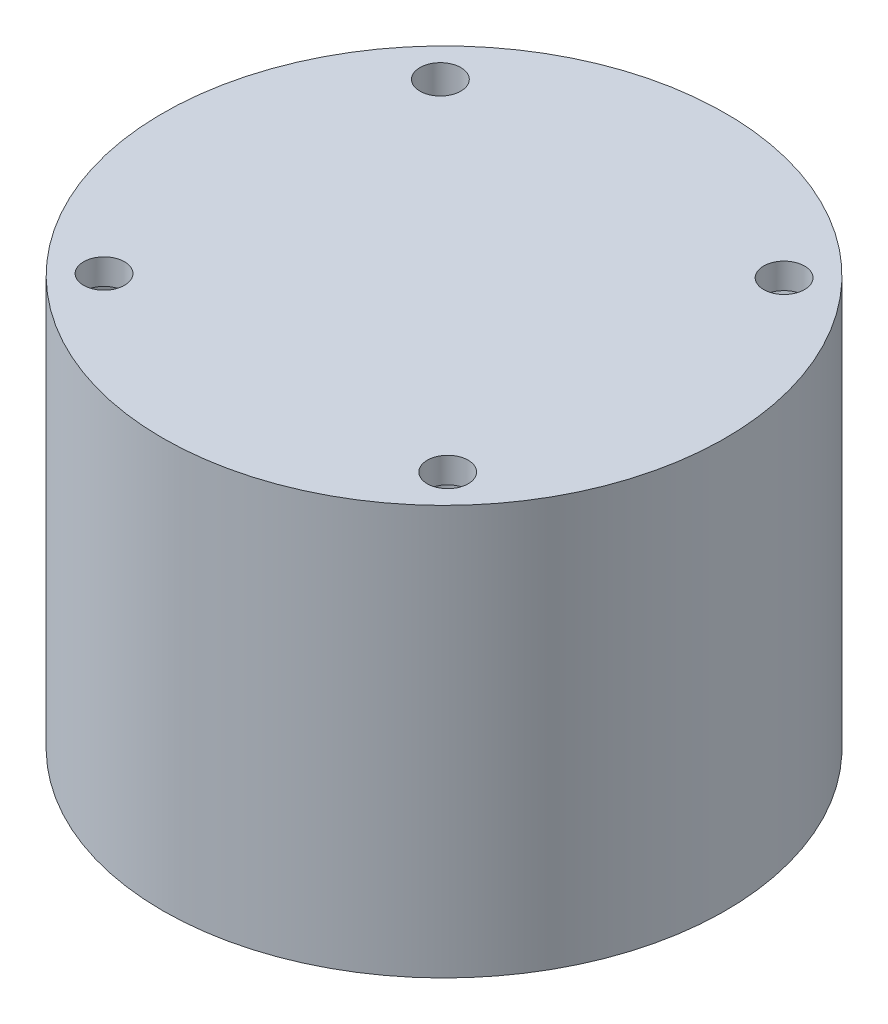
ISO-10303-21;
HEADER;
FILE_DESCRIPTION(('STEP AP214'),'2;1');
FILE_NAME('part.step','',(''),(''),'','','');
FILE_SCHEMA(('AUTOMOTIVE_DESIGN { 1 0 10303 214 1 1 1 1 }'));
ENDSEC;
DATA;
#1=APPLICATION_CONTEXT('core data for automotive mechanical design processes');
#2=APPLICATION_PROTOCOL_DEFINITION('international standard','automotive_design',2000,#1);
#3=PRODUCT_CONTEXT('',#1,'mechanical');
#4=PRODUCT('Part','Part','',(#3));
#5=PRODUCT_RELATED_PRODUCT_CATEGORY('part','',(#4));
#6=PRODUCT_DEFINITION_FORMATION('','',#4);
#7=PRODUCT_DEFINITION_CONTEXT('part definition',#1,'design');
#8=PRODUCT_DEFINITION('design','',#6,#7);
#9=PRODUCT_DEFINITION_SHAPE('','',#8);
#10=(LENGTH_UNIT() NAMED_UNIT(*) SI_UNIT(.MILLI.,.METRE.));
#11=(NAMED_UNIT(*) PLANE_ANGLE_UNIT() SI_UNIT($,.RADIAN.));
#12=(NAMED_UNIT(*) SI_UNIT($,.STERADIAN.) SOLID_ANGLE_UNIT());
#13=UNCERTAINTY_MEASURE_WITH_UNIT(LENGTH_MEASURE(1.E-05),#10,'distance_accuracy_value','');
#14=(GEOMETRIC_REPRESENTATION_CONTEXT(3) GLOBAL_UNCERTAINTY_ASSIGNED_CONTEXT((#13)) GLOBAL_UNIT_ASSIGNED_CONTEXT((#10,
#11,#12)) REPRESENTATION_CONTEXT('',''));
#15=CARTESIAN_POINT('',(0.,0.,0.));
#16=DIRECTION('',(0.,0.,1.));
#17=DIRECTION('',(1.,0.,0.));
#18=AXIS2_PLACEMENT_3D('',#15,#16,#17);
#19=CARTESIAN_POINT('',(0.,75.,0.));
#20=DIRECTION('',(0.,-1.,0.));
#21=DIRECTION('',(0.,0.,-1.));
#22=AXIS2_PLACEMENT_3D('',#19,#20,#21);
#23=CYLINDRICAL_SURFACE('',#22,50.);
#24=CARTESIAN_POINT('',(0.,75.,0.));
#25=DIRECTION('',(0.,-1.,0.));
#26=DIRECTION('',(0.,0.,-1.));
#27=AXIS2_PLACEMENT_3D('',#24,#25,#26);
#28=CIRCLE('',#27,50.);
#29=CARTESIAN_POINT('',(-37.590562846943,75.,32.9689184664894));
#30=VERTEX_POINT('',#29);
#31=CARTESIAN_POINT('',(-37.590562846943,75.,-32.9689184664894));
#32=VERTEX_POINT('',#31);
#33=EDGE_CURVE('E170',#30,#32,#28,.T.);
#34=ORIENTED_EDGE('',*,*,#33,.F.);
#35=DIRECTION('',(0.,1.,0.));
#36=VECTOR('',#35,1.);
#37=CARTESIAN_POINT('',(-37.5905628469429,40.,32.9689184664894));
#38=LINE('',#37,#36);
#39=CARTESIAN_POINT('',(-37.5905628469429,0.,32.9689184664895));
#40=VERTEX_POINT('',#39);
#41=EDGE_CURVE('E143',#30,#40,#38,.F.);
#42=ORIENTED_EDGE('',*,*,#41,.T.);
#43=CARTESIAN_POINT('',(0.,0.,0.));
#44=DIRECTION('',(0.,-1.,0.));
#45=DIRECTION('',(0.,0.,-1.));
#46=AXIS2_PLACEMENT_3D('',#43,#44,#45);
#47=CIRCLE('',#46,50.);
#48=CARTESIAN_POINT('',(-37.5905628469429,0.,-32.9689184664895));
#49=VERTEX_POINT('',#48);
#50=EDGE_CURVE('E126',#40,#49,#47,.T.);
#51=ORIENTED_EDGE('',*,*,#50,.T.);
#52=DIRECTION('',(0.,1.,0.));
#53=VECTOR('',#52,1.);
#54=CARTESIAN_POINT('',(-37.5905628469429,40.,-32.9689184664894));
#55=LINE('',#54,#53);
#56=EDGE_CURVE('E114',#49,#32,#55,.T.);
#57=ORIENTED_EDGE('',*,*,#56,.T.);
#58=EDGE_LOOP('',(#34,#42,#51,#57));
#59=FACE_BOUND('',#58,.T.);
#60=ADVANCED_FACE('F34',(#59),#23,.F.);
#61=CARTESIAN_POINT('',(-33.7747495446767,75.,-36.8682287775581));
#62=VERTEX_POINT('',#61);
#63=CARTESIAN_POINT('',(33.7747495446767,75.,-36.8682287775581));
#64=VERTEX_POINT('',#63);
#65=EDGE_CURVE('E135',#62,#64,#28,.T.);
#66=ORIENTED_EDGE('',*,*,#65,.F.);
#67=DIRECTION('',(0.,1.,0.));
#68=VECTOR('',#67,1.);
#69=CARTESIAN_POINT('',(-33.7747495446767,40.,-36.868228777558));
#70=LINE('',#69,#68);
#71=CARTESIAN_POINT('',(-33.7747495446768,0.,-36.868228777558));
#72=VERTEX_POINT('',#71);
#73=EDGE_CURVE('E57',#62,#72,#70,.F.);
#74=ORIENTED_EDGE('',*,*,#73,.T.);
#75=CARTESIAN_POINT('',(33.7747495446768,0.,-36.868228777558));
#76=VERTEX_POINT('',#75);
#77=EDGE_CURVE('E122',#72,#76,#47,.T.);
#78=ORIENTED_EDGE('',*,*,#77,.T.);
#79=DIRECTION('',(0.,1.,0.));
#80=VECTOR('',#79,1.);
#81=CARTESIAN_POINT('',(33.7747495446767,40.,-36.868228777558));
#82=LINE('',#81,#80);
#83=EDGE_CURVE('E99',#76,#64,#82,.T.);
#84=ORIENTED_EDGE('',*,*,#83,.T.);
#85=EDGE_LOOP('',(#66,#74,#78,#84));
#86=FACE_BOUND('',#85,.T.);
#87=ADVANCED_FACE('F183',(#86),#23,.F.);
#88=CARTESIAN_POINT('',(37.590562846943,75.,-32.9689184664895));
#89=VERTEX_POINT('',#88);
#90=CARTESIAN_POINT('',(37.590562846943,75.,32.9689184664894));
#91=VERTEX_POINT('',#90);
#92=EDGE_CURVE('E113',#89,#91,#28,.T.);
#93=ORIENTED_EDGE('',*,*,#92,.F.);
#94=DIRECTION('',(0.,1.,0.));
#95=VECTOR('',#94,1.);
#96=CARTESIAN_POINT('',(37.5905628469429,40.,-32.9689184664895));
#97=LINE('',#96,#95);
#98=CARTESIAN_POINT('',(37.5905628469429,0.,-32.9689184664896));
#99=VERTEX_POINT('',#98);
#100=EDGE_CURVE('E49',#89,#99,#97,.F.);
#101=ORIENTED_EDGE('',*,*,#100,.T.);
#102=CARTESIAN_POINT('',(37.5905628469429,0.,32.9689184664895));
#103=VERTEX_POINT('',#102);
#104=EDGE_CURVE('E111',#99,#103,#47,.T.);
#105=ORIENTED_EDGE('',*,*,#104,.T.);
#106=DIRECTION('',(0.,1.,0.));
#107=VECTOR('',#106,1.);
#108=CARTESIAN_POINT('',(37.5905628469429,40.,32.9689184664894));
#109=LINE('',#108,#107);
#110=EDGE_CURVE('E128',#103,#91,#109,.T.);
#111=ORIENTED_EDGE('',*,*,#110,.T.);
#112=EDGE_LOOP('',(#93,#101,#105,#111));
#113=FACE_BOUND('',#112,.T.);
#114=ADVANCED_FACE('F109',(#113),#23,.F.);
#115=CARTESIAN_POINT('',(0.,80.,0.));
#116=DIRECTION('',(0.,-1.,0.));
#117=DIRECTION('',(0.,0.,-1.));
#118=AXIS2_PLACEMENT_3D('',#115,#116,#117);
#119=CYLINDRICAL_SURFACE('',#118,55.);
#120=CARTESIAN_POINT('',(0.,80.,0.));
#121=DIRECTION('',(0.,1.,0.));
#122=DIRECTION('',(0.,0.,1.));
#123=AXIS2_PLACEMENT_3D('',#120,#121,#122);
#124=CIRCLE('',#123,55.);
#125=CARTESIAN_POINT('',(0.,80.,55.));
#126=VERTEX_POINT('',#125);
#127=EDGE_CURVE('E176',#126,#126,#124,.T.);
#128=ORIENTED_EDGE('',*,*,#127,.F.);
#129=EDGE_LOOP('',(#128));
#130=FACE_BOUND('',#129,.T.);
#131=CARTESIAN_POINT('',(0.,0.,0.));
#132=DIRECTION('',(0.,1.,0.));
#133=DIRECTION('',(0.,0.,1.));
#134=AXIS2_PLACEMENT_3D('',#131,#132,#133);
#135=CIRCLE('',#134,55.);
#136=CARTESIAN_POINT('',(0.,0.,55.));
#137=VERTEX_POINT('',#136);
#138=EDGE_CURVE('E169',#137,#137,#135,.T.);
#139=ORIENTED_EDGE('',*,*,#138,.T.);
#140=EDGE_LOOP('',(#139));
#141=FACE_BOUND('',#140,.T.);
#142=ADVANCED_FACE('F36',(#130,#141),#119,.T.);
#143=CARTESIAN_POINT('',(0.,80.,0.));
#144=DIRECTION('',(0.,1.,0.));
#145=DIRECTION('',(0.,0.,1.));
#146=AXIS2_PLACEMENT_3D('',#143,#144,#145);
#147=PLANE('',#146);
#148=CARTESIAN_POINT('',(-33.5917270558466,80.,32.8724181253145));
#149=DIRECTION('',(0.,1.,0.));
#150=DIRECTION('',(0.,0.,1.));
#151=AXIS2_PLACEMENT_3D('',#148,#149,#150);
#152=CIRCLE('',#151,4.);
#153=CARTESIAN_POINT('',(-33.5917270558466,80.,36.8724181253145));
#154=VERTEX_POINT('',#153);
#155=EDGE_CURVE('E148',#154,#154,#152,.T.);
#156=ORIENTED_EDGE('',*,*,#155,.F.);
#157=EDGE_LOOP('',(#156));
#158=FACE_BOUND('',#157,.T.);
#159=CARTESIAN_POINT('',(-33.5917270558466,80.,-32.8724181253145));
#160=DIRECTION('',(0.,1.,0.));
#161=DIRECTION('',(0.,0.,1.));
#162=AXIS2_PLACEMENT_3D('',#159,#160,#161);
#163=CIRCLE('',#162,4.);
#164=CARTESIAN_POINT('',(-33.5917270558466,80.,-28.8724181253145));
#165=VERTEX_POINT('',#164);
#166=EDGE_CURVE('E104',#165,#165,#163,.T.);
#167=ORIENTED_EDGE('',*,*,#166,.F.);
#168=EDGE_LOOP('',(#167));
#169=FACE_BOUND('',#168,.T.);
#170=CARTESIAN_POINT('',(33.5917270558466,80.,-32.8724181253145));
#171=DIRECTION('',(0.,1.,0.));
#172=DIRECTION('',(0.,0.,1.));
#173=AXIS2_PLACEMENT_3D('',#170,#171,#172);
#174=CIRCLE('',#173,4.);
#175=CARTESIAN_POINT('',(33.5917270558466,80.,-28.8724181253145));
#176=VERTEX_POINT('',#175);
#177=EDGE_CURVE('E105',#176,#176,#174,.T.);
#178=ORIENTED_EDGE('',*,*,#177,.F.);
#179=EDGE_LOOP('',(#178));
#180=FACE_BOUND('',#179,.T.);
#181=CARTESIAN_POINT('',(33.5917270558466,80.,32.8724181253145));
#182=DIRECTION('',(0.,1.,0.));
#183=DIRECTION('',(0.,0.,1.));
#184=AXIS2_PLACEMENT_3D('',#181,#182,#183);
#185=CIRCLE('',#184,4.00000000000001);
#186=CARTESIAN_POINT('',(33.5917270558466,80.,36.8724181253145));
#187=VERTEX_POINT('',#186);
#188=EDGE_CURVE('E164',#187,#187,#185,.T.);
#189=ORIENTED_EDGE('',*,*,#188,.F.);
#190=EDGE_LOOP('',(#189));
#191=FACE_BOUND('',#190,.T.);
#192=ORIENTED_EDGE('',*,*,#127,.T.);
#193=EDGE_LOOP('',(#192));
#194=FACE_BOUND('',#193,.T.);
#195=ADVANCED_FACE('F195',(#158,#169,#180,#191,#194),#147,.T.);
#196=CARTESIAN_POINT('',(0.,0.,0.));
#197=DIRECTION('',(0.,1.,0.));
#198=DIRECTION('',(0.,0.,1.));
#199=AXIS2_PLACEMENT_3D('',#196,#197,#198);
#200=PLANE('',#199);
#201=ORIENTED_EDGE('',*,*,#50,.F.);
#202=CARTESIAN_POINT('',(-33.5917270558466,0.,32.8724181253145));
#203=DIRECTION('',(0.,1.,0.));
#204=DIRECTION('',(0.,0.,1.));
#205=AXIS2_PLACEMENT_3D('',#202,#203,#204);
#206=CIRCLE('',#205,4.);
#207=CARTESIAN_POINT('',(-33.7747495446768,0.,36.868228777558));
#208=VERTEX_POINT('',#207);
#209=EDGE_CURVE('E146',#40,#208,#206,.T.);
#210=ORIENTED_EDGE('',*,*,#209,.T.);
#211=CARTESIAN_POINT('',(33.7747495446768,0.,36.868228777558));
#212=VERTEX_POINT('',#211);
#213=EDGE_CURVE('E125',#212,#208,#47,.T.);
#214=ORIENTED_EDGE('',*,*,#213,.F.);
#215=CARTESIAN_POINT('',(33.5917270558466,0.,32.8724181253145));
#216=DIRECTION('',(0.,1.,0.));
#217=DIRECTION('',(0.,0.,1.));
#218=AXIS2_PLACEMENT_3D('',#215,#216,#217);
#219=CIRCLE('',#218,4.00000000000001);
#220=EDGE_CURVE('E121',#212,#103,#219,.T.);
#221=ORIENTED_EDGE('',*,*,#220,.T.);
#222=ORIENTED_EDGE('',*,*,#104,.F.);
#223=CARTESIAN_POINT('',(33.5917270558466,0.,-32.8724181253145));
#224=DIRECTION('',(0.,1.,0.));
#225=DIRECTION('',(0.,0.,1.));
#226=AXIS2_PLACEMENT_3D('',#223,#224,#225);
#227=CIRCLE('',#226,4.);
#228=EDGE_CURVE('E96',#99,#76,#227,.T.);
#229=ORIENTED_EDGE('',*,*,#228,.T.);
#230=ORIENTED_EDGE('',*,*,#77,.F.);
#231=CARTESIAN_POINT('',(-33.5917270558466,0.,-32.8724181253145));
#232=DIRECTION('',(0.,1.,0.));
#233=DIRECTION('',(0.,0.,1.));
#234=AXIS2_PLACEMENT_3D('',#231,#232,#233);
#235=CIRCLE('',#234,4.);
#236=EDGE_CURVE('E147',#72,#49,#235,.T.);
#237=ORIENTED_EDGE('',*,*,#236,.T.);
#238=EDGE_LOOP('',(#201,#210,#214,#221,#222,#229,#230,#237));
#239=FACE_BOUND('',#238,.T.);
#240=ORIENTED_EDGE('',*,*,#138,.F.);
#241=EDGE_LOOP('',(#240));
#242=FACE_BOUND('',#241,.T.);
#243=ADVANCED_FACE('F118',(#239,#242),#200,.F.);
#244=ORIENTED_EDGE('',*,*,#213,.T.);
#245=DIRECTION('',(0.,1.,0.));
#246=VECTOR('',#245,1.);
#247=CARTESIAN_POINT('',(-33.7747495446767,40.,36.868228777558));
#248=LINE('',#247,#246);
#249=CARTESIAN_POINT('',(-33.7747495446767,75.,36.8682287775581));
#250=VERTEX_POINT('',#249);
#251=EDGE_CURVE('E161',#208,#250,#248,.T.);
#252=ORIENTED_EDGE('',*,*,#251,.T.);
#253=CARTESIAN_POINT('',(33.7747495446767,75.,36.8682287775581));
#254=VERTEX_POINT('',#253);
#255=EDGE_CURVE('E136',#254,#250,#28,.T.);
#256=ORIENTED_EDGE('',*,*,#255,.F.);
#257=DIRECTION('',(0.,1.,0.));
#258=VECTOR('',#257,1.);
#259=CARTESIAN_POINT('',(33.7747495446767,40.,36.868228777558));
#260=LINE('',#259,#258);
#261=EDGE_CURVE('E123',#254,#212,#260,.F.);
#262=ORIENTED_EDGE('',*,*,#261,.T.);
#263=EDGE_LOOP('',(#244,#252,#256,#262));
#264=FACE_BOUND('',#263,.T.);
#265=ADVANCED_FACE('F190',(#264),#23,.F.);
#266=CARTESIAN_POINT('',(0.,75.,0.));
#267=DIRECTION('',(0.,-1.,0.));
#268=DIRECTION('',(0.,0.,-1.));
#269=AXIS2_PLACEMENT_3D('',#266,#267,#268);
#270=PLANE('',#269);
#271=CARTESIAN_POINT('',(-33.5917270558466,75.,32.8724181253145));
#272=DIRECTION('',(0.,-1.,0.));
#273=DIRECTION('',(0.,0.,-1.));
#274=AXIS2_PLACEMENT_3D('',#271,#272,#273);
#275=CIRCLE('',#274,4.);
#276=EDGE_CURVE('E11',#30,#250,#275,.T.);
#277=ORIENTED_EDGE('',*,*,#276,.F.);
#278=ORIENTED_EDGE('',*,*,#33,.T.);
#279=CARTESIAN_POINT('',(-33.5917270558466,75.,-32.8724181253145));
#280=DIRECTION('',(0.,-1.,0.));
#281=DIRECTION('',(0.,0.,-1.));
#282=AXIS2_PLACEMENT_3D('',#279,#280,#281);
#283=CIRCLE('',#282,4.);
#284=EDGE_CURVE('E42',#62,#32,#283,.T.);
#285=ORIENTED_EDGE('',*,*,#284,.F.);
#286=ORIENTED_EDGE('',*,*,#65,.T.);
#287=CARTESIAN_POINT('',(33.5917270558466,75.,-32.8724181253145));
#288=DIRECTION('',(0.,-1.,0.));
#289=DIRECTION('',(0.,0.,-1.));
#290=AXIS2_PLACEMENT_3D('',#287,#288,#289);
#291=CIRCLE('',#290,4.);
#292=EDGE_CURVE('E181',#89,#64,#291,.T.);
#293=ORIENTED_EDGE('',*,*,#292,.F.);
#294=ORIENTED_EDGE('',*,*,#92,.T.);
#295=CARTESIAN_POINT('',(33.5917270558466,75.,32.8724181253145));
#296=DIRECTION('',(0.,-1.,0.));
#297=DIRECTION('',(0.,0.,-1.));
#298=AXIS2_PLACEMENT_3D('',#295,#296,#297);
#299=CIRCLE('',#298,4.00000000000001);
#300=EDGE_CURVE('E295',#254,#91,#299,.T.);
#301=ORIENTED_EDGE('',*,*,#300,.F.);
#302=ORIENTED_EDGE('',*,*,#255,.T.);
#303=EDGE_LOOP('',(#277,#278,#285,#286,#293,#294,#301,#302));
#304=FACE_BOUND('',#303,.T.);
#305=ADVANCED_FACE('F180',(#304),#270,.T.);
#306=CARTESIAN_POINT('',(33.5917270558466,0.,32.8724181253145));
#307=DIRECTION('',(0.,1.,0.));
#308=DIRECTION('',(0.,0.,1.));
#309=AXIS2_PLACEMENT_3D('',#306,#307,#308);
#310=CYLINDRICAL_SURFACE('',#309,4.00000000000001);
#311=ORIENTED_EDGE('',*,*,#188,.T.);
#312=EDGE_LOOP('',(#311));
#313=FACE_BOUND('',#312,.T.);
#314=ORIENTED_EDGE('',*,*,#300,.T.);
#315=ORIENTED_EDGE('',*,*,#110,.F.);
#316=ORIENTED_EDGE('',*,*,#220,.F.);
#317=ORIENTED_EDGE('',*,*,#261,.F.);
#318=EDGE_LOOP('',(#314,#315,#316,#317));
#319=FACE_BOUND('',#318,.T.);
#320=ADVANCED_FACE('F216',(#313,#319),#310,.F.);
#321=CARTESIAN_POINT('',(33.5917270558466,0.,-32.8724181253145));
#322=DIRECTION('',(0.,1.,0.));
#323=DIRECTION('',(0.,0.,1.));
#324=AXIS2_PLACEMENT_3D('',#321,#322,#323);
#325=CYLINDRICAL_SURFACE('',#324,4.);
#326=ORIENTED_EDGE('',*,*,#177,.T.);
#327=EDGE_LOOP('',(#326));
#328=FACE_BOUND('',#327,.T.);
#329=ORIENTED_EDGE('',*,*,#292,.T.);
#330=ORIENTED_EDGE('',*,*,#83,.F.);
#331=ORIENTED_EDGE('',*,*,#228,.F.);
#332=ORIENTED_EDGE('',*,*,#100,.F.);
#333=EDGE_LOOP('',(#329,#330,#331,#332));
#334=FACE_BOUND('',#333,.T.);
#335=ADVANCED_FACE('F97',(#328,#334),#325,.F.);
#336=CARTESIAN_POINT('',(-33.5917270558466,0.,-32.8724181253145));
#337=DIRECTION('',(0.,1.,0.));
#338=DIRECTION('',(0.,0.,1.));
#339=AXIS2_PLACEMENT_3D('',#336,#337,#338);
#340=CYLINDRICAL_SURFACE('',#339,4.);
#341=ORIENTED_EDGE('',*,*,#166,.T.);
#342=EDGE_LOOP('',(#341));
#343=FACE_BOUND('',#342,.T.);
#344=ORIENTED_EDGE('',*,*,#284,.T.);
#345=ORIENTED_EDGE('',*,*,#56,.F.);
#346=ORIENTED_EDGE('',*,*,#236,.F.);
#347=ORIENTED_EDGE('',*,*,#73,.F.);
#348=EDGE_LOOP('',(#344,#345,#346,#347));
#349=FACE_BOUND('',#348,.T.);
#350=ADVANCED_FACE('F227',(#343,#349),#340,.F.);
#351=CARTESIAN_POINT('',(-33.5917270558466,0.,32.8724181253145));
#352=DIRECTION('',(0.,1.,0.));
#353=DIRECTION('',(0.,0.,1.));
#354=AXIS2_PLACEMENT_3D('',#351,#352,#353);
#355=CYLINDRICAL_SURFACE('',#354,4.);
#356=ORIENTED_EDGE('',*,*,#155,.T.);
#357=EDGE_LOOP('',(#356));
#358=FACE_BOUND('',#357,.T.);
#359=ORIENTED_EDGE('',*,*,#276,.T.);
#360=ORIENTED_EDGE('',*,*,#251,.F.);
#361=ORIENTED_EDGE('',*,*,#209,.F.);
#362=ORIENTED_EDGE('',*,*,#41,.F.);
#363=EDGE_LOOP('',(#359,#360,#361,#362));
#364=FACE_BOUND('',#363,.T.);
#365=ADVANCED_FACE('F235',(#358,#364),#355,.F.);
#366=CLOSED_SHELL('',(#60,#87,#114,#142,#195,#243,#265,#305,#320,#335,#350,#365));
#367=MANIFOLD_SOLID_BREP('B2',#366);
#368=ADVANCED_BREP_SHAPE_REPRESENTATION('',(#18,#367),#14);
#369=SHAPE_DEFINITION_REPRESENTATION(#9,#368);
ENDSEC;
END-ISO-10303-21;
